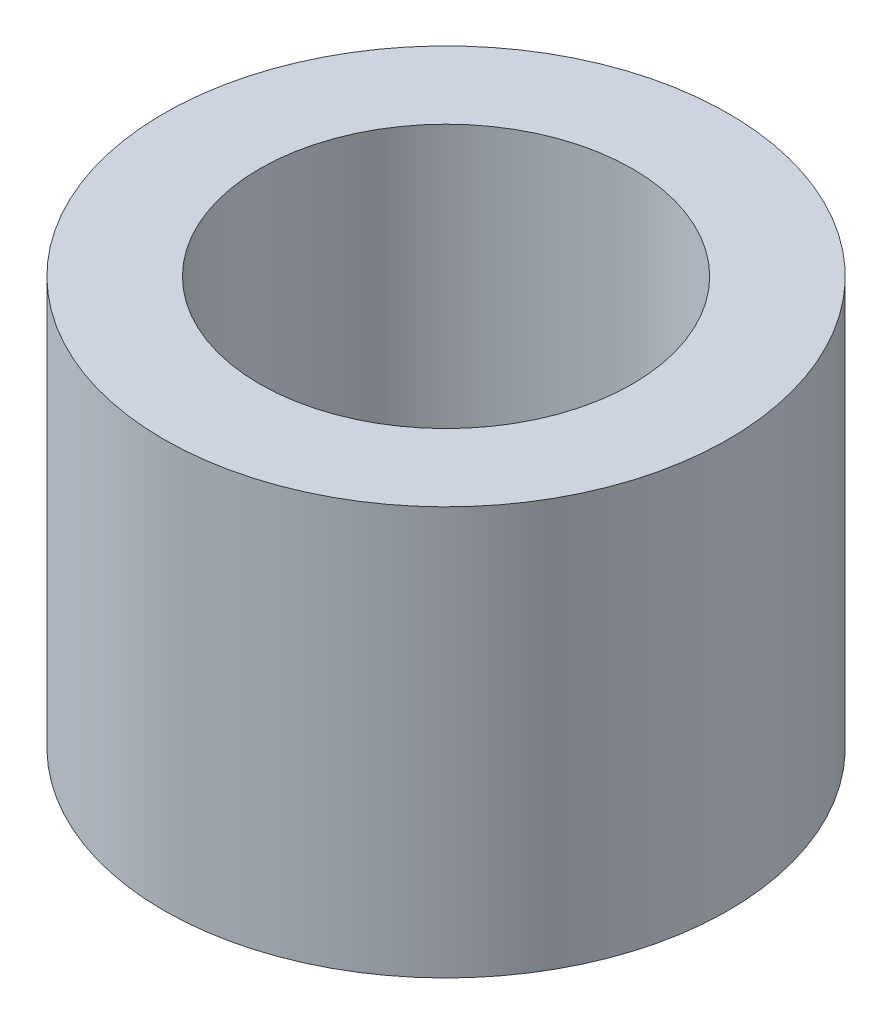
ISO-10303-21;
HEADER;
FILE_DESCRIPTION(('STEP AP214'),'2;1');
FILE_NAME('part.step','',(''),(''),'','','');
FILE_SCHEMA(('AUTOMOTIVE_DESIGN { 1 0 10303 214 1 1 1 1 }'));
ENDSEC;
DATA;
#1=APPLICATION_CONTEXT('core data for automotive mechanical design processes');
#2=APPLICATION_PROTOCOL_DEFINITION('international standard','automotive_design',2000,#1);
#3=PRODUCT_CONTEXT('',#1,'mechanical');
#4=PRODUCT('Part','Part','',(#3));
#5=PRODUCT_RELATED_PRODUCT_CATEGORY('part','',(#4));
#6=PRODUCT_DEFINITION_FORMATION('','',#4);
#7=PRODUCT_DEFINITION_CONTEXT('part definition',#1,'design');
#8=PRODUCT_DEFINITION('design','',#6,#7);
#9=PRODUCT_DEFINITION_SHAPE('','',#8);
#10=(LENGTH_UNIT() NAMED_UNIT(*) SI_UNIT(.MILLI.,.METRE.));
#11=(NAMED_UNIT(*) PLANE_ANGLE_UNIT() SI_UNIT($,.RADIAN.));
#12=(NAMED_UNIT(*) SI_UNIT($,.STERADIAN.) SOLID_ANGLE_UNIT());
#13=UNCERTAINTY_MEASURE_WITH_UNIT(LENGTH_MEASURE(1.E-05),#10,'distance_accuracy_value','');
#14=(GEOMETRIC_REPRESENTATION_CONTEXT(3) GLOBAL_UNCERTAINTY_ASSIGNED_CONTEXT((#13)) GLOBAL_UNIT_ASSIGNED_CONTEXT((#10,
#11,#12)) REPRESENTATION_CONTEXT('',''));
#15=CARTESIAN_POINT('',(0.,0.,0.));
#16=DIRECTION('',(0.,0.,1.));
#17=DIRECTION('',(1.,0.,0.));
#18=AXIS2_PLACEMENT_3D('',#15,#16,#17);
#19=CARTESIAN_POINT('',(0.,28.9111227753701,0.));
#20=DIRECTION('',(0.,-1.,0.));
#21=DIRECTION('',(0.,0.,-1.));
#22=AXIS2_PLACEMENT_3D('',#19,#20,#21);
#23=CYLINDRICAL_SURFACE('',#22,20.);
#24=CARTESIAN_POINT('',(0.,28.9111227753701,0.));
#25=DIRECTION('',(0.,1.,0.));
#26=DIRECTION('',(0.,0.,1.));
#27=AXIS2_PLACEMENT_3D('',#24,#25,#26);
#28=CIRCLE('',#27,20.);
#29=CARTESIAN_POINT('',(0.,28.9111227753701,20.));
#30=VERTEX_POINT('',#29);
#31=EDGE_CURVE('E10',#30,#30,#28,.T.);
#32=ORIENTED_EDGE('',*,*,#31,.F.);
#33=EDGE_LOOP('',(#32));
#34=FACE_BOUND('',#33,.T.);
#35=CARTESIAN_POINT('',(0.,0.,0.));
#36=DIRECTION('',(0.,1.,0.));
#37=DIRECTION('',(0.,0.,1.));
#38=AXIS2_PLACEMENT_3D('',#35,#36,#37);
#39=CIRCLE('',#38,20.);
#40=CARTESIAN_POINT('',(0.,0.,20.));
#41=VERTEX_POINT('',#40);
#42=EDGE_CURVE('E37',#41,#41,#39,.T.);
#43=ORIENTED_EDGE('',*,*,#42,.T.);
#44=EDGE_LOOP('',(#43));
#45=FACE_BOUND('',#44,.T.);
#46=ADVANCED_FACE('F40',(#34,#45),#23,.T.);
#47=CARTESIAN_POINT('',(0.,28.9111227753701,0.));
#48=DIRECTION('',(0.,1.,0.));
#49=DIRECTION('',(0.,0.,1.));
#50=AXIS2_PLACEMENT_3D('',#47,#48,#49);
#51=PLANE('',#50);
#52=CARTESIAN_POINT('',(0.,28.9111227753701,0.));
#53=DIRECTION('',(0.,1.,0.));
#54=DIRECTION('',(0.,0.,1.));
#55=AXIS2_PLACEMENT_3D('',#52,#53,#54);
#56=CIRCLE('',#55,13.2089306435402);
#57=CARTESIAN_POINT('',(0.,28.9111227753701,13.2089306435402));
#58=VERTEX_POINT('',#57);
#59=EDGE_CURVE('E50',#58,#58,#56,.T.);
#60=ORIENTED_EDGE('',*,*,#59,.F.);
#61=EDGE_LOOP('',(#60));
#62=FACE_BOUND('',#61,.T.);
#63=ORIENTED_EDGE('',*,*,#31,.T.);
#64=EDGE_LOOP('',(#63));
#65=FACE_BOUND('',#64,.T.);
#66=ADVANCED_FACE('F59',(#62,#65),#51,.T.);
#67=CARTESIAN_POINT('',(0.,0.,0.));
#68=DIRECTION('',(0.,1.,0.));
#69=DIRECTION('',(0.,0.,1.));
#70=AXIS2_PLACEMENT_3D('',#67,#68,#69);
#71=PLANE('',#70);
#72=CARTESIAN_POINT('',(0.,0.,0.));
#73=DIRECTION('',(0.,1.,0.));
#74=DIRECTION('',(0.,0.,1.));
#75=AXIS2_PLACEMENT_3D('',#72,#73,#74);
#76=CIRCLE('',#75,13.2089306435402);
#77=CARTESIAN_POINT('',(0.,0.,13.2089306435402));
#78=VERTEX_POINT('',#77);
#79=EDGE_CURVE('E47',#78,#78,#76,.T.);
#80=ORIENTED_EDGE('',*,*,#79,.T.);
#81=EDGE_LOOP('',(#80));
#82=FACE_BOUND('',#81,.T.);
#83=ORIENTED_EDGE('',*,*,#42,.F.);
#84=EDGE_LOOP('',(#83));
#85=FACE_BOUND('',#84,.T.);
#86=ADVANCED_FACE('F58',(#82,#85),#71,.F.);
#87=CARTESIAN_POINT('',(0.,28.9111227753701,0.));
#88=DIRECTION('',(0.,-1.,0.));
#89=DIRECTION('',(0.,0.,-1.));
#90=AXIS2_PLACEMENT_3D('',#87,#88,#89);
#91=CYLINDRICAL_SURFACE('',#90,13.2089306435402);
#92=ORIENTED_EDGE('',*,*,#59,.T.);
#93=EDGE_LOOP('',(#92));
#94=FACE_BOUND('',#93,.T.);
#95=ORIENTED_EDGE('',*,*,#79,.F.);
#96=EDGE_LOOP('',(#95));
#97=FACE_BOUND('',#96,.T.);
#98=ADVANCED_FACE('F54',(#94,#97),#91,.F.);
#99=CLOSED_SHELL('',(#46,#66,#86,#98));
#100=MANIFOLD_SOLID_BREP('B2',#99);
#101=ADVANCED_BREP_SHAPE_REPRESENTATION('',(#18,#100),#14);
#102=SHAPE_DEFINITION_REPRESENTATION(#9,#101);
ENDSEC;
END-ISO-10303-21;
